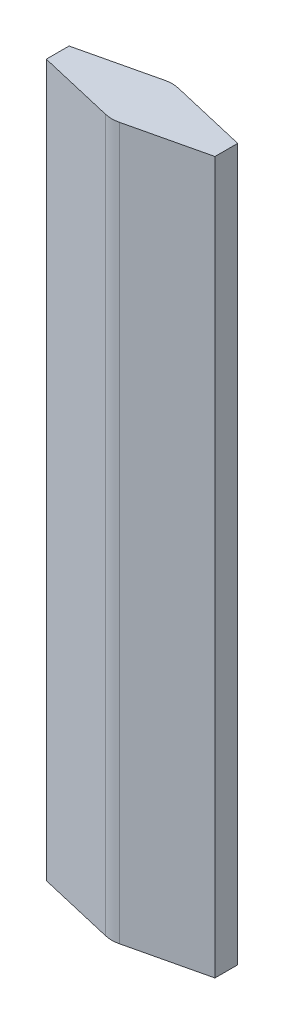
ISO-10303-21;
HEADER;
FILE_DESCRIPTION(('STEP AP214'),'2;1');
FILE_NAME('part.step','',(''),(''),'','','');
FILE_SCHEMA(('AUTOMOTIVE_DESIGN { 1 0 10303 214 1 1 1 1 }'));
ENDSEC;
DATA;
#1=APPLICATION_CONTEXT('core data for automotive mechanical design processes');
#2=APPLICATION_PROTOCOL_DEFINITION('international standard','automotive_design',2000,#1);
#3=PRODUCT_CONTEXT('',#1,'mechanical');
#4=PRODUCT('Part','Part','',(#3));
#5=PRODUCT_RELATED_PRODUCT_CATEGORY('part','',(#4));
#6=PRODUCT_DEFINITION_FORMATION('','',#4);
#7=PRODUCT_DEFINITION_CONTEXT('part definition',#1,'design');
#8=PRODUCT_DEFINITION('design','',#6,#7);
#9=PRODUCT_DEFINITION_SHAPE('','',#8);
#10=(LENGTH_UNIT() NAMED_UNIT(*) SI_UNIT(.MILLI.,.METRE.));
#11=(NAMED_UNIT(*) PLANE_ANGLE_UNIT() SI_UNIT($,.RADIAN.));
#12=(NAMED_UNIT(*) SI_UNIT($,.STERADIAN.) SOLID_ANGLE_UNIT());
#13=UNCERTAINTY_MEASURE_WITH_UNIT(LENGTH_MEASURE(1.E-05),#10,'distance_accuracy_value','');
#14=(GEOMETRIC_REPRESENTATION_CONTEXT(3) GLOBAL_UNCERTAINTY_ASSIGNED_CONTEXT((#13)) GLOBAL_UNIT_ASSIGNED_CONTEXT((#10,
#11,#12)) REPRESENTATION_CONTEXT('',''));
#15=CARTESIAN_POINT('',(0.,0.,0.));
#16=DIRECTION('',(0.,0.,1.));
#17=DIRECTION('',(1.,0.,0.));
#18=AXIS2_PLACEMENT_3D('',#15,#16,#17);
#19=CARTESIAN_POINT('',(-169.28,1600.,31.2266341956425));
#20=DIRECTION('',(0.228,0.,-0.973661132016679));
#21=DIRECTION('',(-0.973661132016679,0.,-0.228));
#22=AXIS2_PLACEMENT_3D('',#19,#20,#21);
#23=PLANE('',#22);
#24=DIRECTION('',(0.973661132016679,0.,0.228));
#25=VECTOR('',#24,1.);
#26=CARTESIAN_POINT('',(-169.28,-10.,31.2266341956425));
#27=LINE('',#26,#25);
#28=CARTESIAN_POINT('',(-191.999999986789,-10.,25.9063437715413));
#29=VERTEX_POINT('',#28);
#30=CARTESIAN_POINT('',(-15.7319998104866,-10.,67.1826181535287));
#31=VERTEX_POINT('',#30);
#32=EDGE_CURVE('E180',#29,#31,#27,.T.);
#33=ORIENTED_EDGE('',*,*,#32,.T.);
#34=DIRECTION('',(0.,-1.,0.));
#35=VECTOR('',#34,1.);
#36=CARTESIAN_POINT('',(-15.7319998104866,1600.,67.1826181535287));
#37=LINE('',#36,#35);
#38=CARTESIAN_POINT('',(-15.7319998104866,1610.,67.1826181535287));
#39=VERTEX_POINT('',#38);
#40=EDGE_CURVE('E182',#39,#31,#37,.T.);
#41=ORIENTED_EDGE('',*,*,#40,.F.);
#42=DIRECTION('',(0.973661132016679,0.,0.228));
#43=VECTOR('',#42,1.);
#44=CARTESIAN_POINT('',(-169.28,1610.,31.2266341956425));
#45=LINE('',#44,#43);
#46=CARTESIAN_POINT('',(-191.999999986789,1610.,25.9063437715413));
#47=VERTEX_POINT('',#46);
#48=EDGE_CURVE('E216',#47,#39,#45,.T.);
#49=ORIENTED_EDGE('',*,*,#48,.F.);
#50=DIRECTION('',(0.,-1.,0.));
#51=VECTOR('',#50,1.);
#52=CARTESIAN_POINT('',(-191.999999986789,1600.,25.9063437715413));
#53=LINE('',#52,#51);
#54=EDGE_CURVE('E185',#47,#29,#53,.T.);
#55=ORIENTED_EDGE('',*,*,#54,.T.);
#56=EDGE_LOOP('',(#33,#41,#49,#55));
#57=FACE_BOUND('',#56,.T.);
#58=ADVANCED_FACE('F40',(#57),#23,.F.);
#59=CARTESIAN_POINT('',(0.,1600.,0.));
#60=DIRECTION('',(0.,-1.,0.));
#61=DIRECTION('',(0.,0.,-1.));
#62=AXIS2_PLACEMENT_3D('',#59,#60,#61);
#63=CYLINDRICAL_SURFACE('',#62,69.);
#64=CARTESIAN_POINT('',(0.,-10.,0.));
#65=DIRECTION('',(0.,1.,0.));
#66=DIRECTION('',(0.,0.,1.));
#67=AXIS2_PLACEMENT_3D('',#64,#65,#66);
#68=CIRCLE('',#67,69.);
#69=CARTESIAN_POINT('',(15.7319999932996,-10.,67.1826180869688));
#70=VERTEX_POINT('',#69);
#71=EDGE_CURVE('E189',#31,#70,#68,.T.);
#72=ORIENTED_EDGE('',*,*,#71,.T.);
#73=DIRECTION('',(0.,1.,0.));
#74=VECTOR('',#73,1.);
#75=CARTESIAN_POINT('',(15.7319999932996,1600.,67.1826180869688));
#76=LINE('',#75,#74);
#77=CARTESIAN_POINT('',(15.7319999932996,1610.,67.1826180869688));
#78=VERTEX_POINT('',#77);
#79=EDGE_CURVE('E198',#78,#70,#76,.F.);
#80=ORIENTED_EDGE('',*,*,#79,.F.);
#81=CARTESIAN_POINT('',(0.,1610.,0.));
#82=DIRECTION('',(0.,1.,0.));
#83=DIRECTION('',(0.,0.,1.));
#84=AXIS2_PLACEMENT_3D('',#81,#82,#83);
#85=CIRCLE('',#84,69.);
#86=EDGE_CURVE('E196',#39,#78,#85,.T.);
#87=ORIENTED_EDGE('',*,*,#86,.F.);
#88=ORIENTED_EDGE('',*,*,#40,.T.);
#89=EDGE_LOOP('',(#72,#80,#87,#88));
#90=FACE_BOUND('',#89,.T.);
#91=ADVANCED_FACE('F193',(#90),#63,.T.);
#92=CARTESIAN_POINT('',(169.279999998572,1600.,31.2266341959768));
#93=DIRECTION('',(-0.227999999857222,0.,-0.973661132050113));
#94=DIRECTION('',(-0.973661132050113,0.,0.227999999857222));
#95=AXIS2_PLACEMENT_3D('',#92,#93,#94);
#96=PLANE('',#95);
#97=DIRECTION('',(0.973661132050113,0.,-0.227999999857222));
#98=VECTOR('',#97,1.);
#99=CARTESIAN_POINT('',(169.279999998572,-10.,31.2266341959768));
#100=LINE('',#99,#98);
#101=CARTESIAN_POINT('',(192.,-10.,25.9063437719621));
#102=VERTEX_POINT('',#101);
#103=EDGE_CURVE('E202',#70,#102,#100,.T.);
#104=ORIENTED_EDGE('',*,*,#103,.T.);
#105=DIRECTION('',(0.,-1.,0.));
#106=VECTOR('',#105,1.);
#107=CARTESIAN_POINT('',(192.,1600.,25.9063437719621));
#108=LINE('',#107,#106);
#109=CARTESIAN_POINT('',(192.,1610.,25.9063437719621));
#110=VERTEX_POINT('',#109);
#111=EDGE_CURVE('E213',#110,#102,#108,.T.);
#112=ORIENTED_EDGE('',*,*,#111,.F.);
#113=DIRECTION('',(0.973661132050113,0.,-0.227999999857222));
#114=VECTOR('',#113,1.);
#115=CARTESIAN_POINT('',(169.279999998572,1610.,31.2266341959768));
#116=LINE('',#115,#114);
#117=EDGE_CURVE('E215',#78,#110,#116,.T.);
#118=ORIENTED_EDGE('',*,*,#117,.F.);
#119=ORIENTED_EDGE('',*,*,#79,.T.);
#120=EDGE_LOOP('',(#104,#112,#118,#119));
#121=FACE_BOUND('',#120,.T.);
#122=ADVANCED_FACE('F355',(#121),#96,.F.);
#123=CARTESIAN_POINT('',(192.,1600.,0.));
#124=DIRECTION('',(-1.,0.,0.));
#125=DIRECTION('',(0.,0.,1.));
#126=AXIS2_PLACEMENT_3D('',#123,#124,#125);
#127=PLANE('',#126);
#128=DIRECTION('',(0.,0.,-1.));
#129=VECTOR('',#128,1.);
#130=CARTESIAN_POINT('',(192.,-10.,0.));
#131=LINE('',#130,#129);
#132=CARTESIAN_POINT('',(192.,-10.,-25.9063437684477));
#133=VERTEX_POINT('',#132);
#134=EDGE_CURVE('E206',#102,#133,#131,.T.);
#135=ORIENTED_EDGE('',*,*,#134,.T.);
#136=DIRECTION('',(0.,-1.,0.));
#137=VECTOR('',#136,1.);
#138=CARTESIAN_POINT('',(192.,1600.,-25.9063437684477));
#139=LINE('',#138,#137);
#140=CARTESIAN_POINT('',(192.,1610.,-25.9063437684477));
#141=VERTEX_POINT('',#140);
#142=EDGE_CURVE('E221',#141,#133,#139,.T.);
#143=ORIENTED_EDGE('',*,*,#142,.F.);
#144=DIRECTION('',(0.,0.,-1.));
#145=VECTOR('',#144,1.);
#146=CARTESIAN_POINT('',(192.,1610.,0.));
#147=LINE('',#146,#145);
#148=EDGE_CURVE('E224',#110,#141,#147,.T.);
#149=ORIENTED_EDGE('',*,*,#148,.F.);
#150=ORIENTED_EDGE('',*,*,#111,.T.);
#151=EDGE_LOOP('',(#135,#143,#149,#150));
#152=FACE_BOUND('',#151,.T.);
#153=ADVANCED_FACE('F348',(#152),#127,.F.);
#154=CARTESIAN_POINT('',(169.28,1600.,-31.2266341956425));
#155=DIRECTION('',(-0.228,0.,0.973661132016679));
#156=DIRECTION('',(0.973661132016679,0.,0.228));
#157=AXIS2_PLACEMENT_3D('',#154,#155,#156);
#158=PLANE('',#157);
#159=DIRECTION('',(-0.973661132016679,0.,-0.228));
#160=VECTOR('',#159,1.);
#161=CARTESIAN_POINT('',(169.28,-10.,-31.2266341956425));
#162=LINE('',#161,#160);
#163=CARTESIAN_POINT('',(15.732,-10.,-67.1826181091508));
#164=VERTEX_POINT('',#163);
#165=EDGE_CURVE('E150',#133,#164,#162,.T.);
#166=ORIENTED_EDGE('',*,*,#165,.T.);
#167=DIRECTION('',(0.,-1.,0.));
#168=VECTOR('',#167,1.);
#169=CARTESIAN_POINT('',(15.732,1600.,-67.1826181091508));
#170=LINE('',#169,#168);
#171=CARTESIAN_POINT('',(15.732,1610.,-67.1826181091508));
#172=VERTEX_POINT('',#171);
#173=EDGE_CURVE('E230',#172,#164,#170,.T.);
#174=ORIENTED_EDGE('',*,*,#173,.F.);
#175=DIRECTION('',(-0.973661132016679,0.,-0.228));
#176=VECTOR('',#175,1.);
#177=CARTESIAN_POINT('',(169.28,1610.,-31.2266341956425));
#178=LINE('',#177,#176);
#179=EDGE_CURVE('E233',#141,#172,#178,.T.);
#180=ORIENTED_EDGE('',*,*,#179,.F.);
#181=ORIENTED_EDGE('',*,*,#142,.T.);
#182=EDGE_LOOP('',(#166,#174,#180,#181));
#183=FACE_BOUND('',#182,.T.);
#184=ADVANCED_FACE('F352',(#183),#158,.F.);
#185=CARTESIAN_POINT('',(0.,1600.,0.));
#186=DIRECTION('',(0.,-1.,0.));
#187=DIRECTION('',(0.,0.,-1.));
#188=AXIS2_PLACEMENT_3D('',#185,#186,#187);
#189=CYLINDRICAL_SURFACE('',#188,69.);
#190=CARTESIAN_POINT('',(0.,-10.,0.));
#191=DIRECTION('',(0.,1.,0.));
#192=DIRECTION('',(0.,0.,1.));
#193=AXIS2_PLACEMENT_3D('',#190,#191,#192);
#194=CIRCLE('',#193,69.);
#195=CARTESIAN_POINT('',(-15.7320000067004,-10.,-67.1826181313328));
#196=VERTEX_POINT('',#195);
#197=EDGE_CURVE('E236',#164,#196,#194,.T.);
#198=ORIENTED_EDGE('',*,*,#197,.T.);
#199=DIRECTION('',(0.,1.,0.));
#200=VECTOR('',#199,1.);
#201=CARTESIAN_POINT('',(-15.7320000067004,1600.,-67.1826181313328));
#202=LINE('',#201,#200);
#203=CARTESIAN_POINT('',(-15.7320000067004,1610.,-67.1826181313328));
#204=VERTEX_POINT('',#203);
#205=EDGE_CURVE('E239',#204,#196,#202,.F.);
#206=ORIENTED_EDGE('',*,*,#205,.F.);
#207=CARTESIAN_POINT('',(0.,1610.,0.));
#208=DIRECTION('',(0.,1.,0.));
#209=DIRECTION('',(0.,0.,1.));
#210=AXIS2_PLACEMENT_3D('',#207,#208,#209);
#211=CIRCLE('',#210,69.);
#212=EDGE_CURVE('E126',#172,#204,#211,.T.);
#213=ORIENTED_EDGE('',*,*,#212,.F.);
#214=ORIENTED_EDGE('',*,*,#173,.T.);
#215=EDGE_LOOP('',(#198,#206,#213,#214));
#216=FACE_BOUND('',#215,.T.);
#217=ADVANCED_FACE('F345',(#216),#189,.T.);
#218=CARTESIAN_POINT('',(-169.280000001428,1600.,-31.2266341953081));
#219=DIRECTION('',(0.228000000142778,0.,0.973661131983245));
#220=DIRECTION('',(0.973661131983245,0.,-0.228000000142778));
#221=AXIS2_PLACEMENT_3D('',#218,#219,#220);
#222=PLANE('',#221);
#223=DIRECTION('',(-0.973661131983245,0.,0.228000000142778));
#224=VECTOR('',#223,1.);
#225=CARTESIAN_POINT('',(-169.280000001428,-10.,-31.2266341953081));
#226=LINE('',#225,#224);
#227=CARTESIAN_POINT('',(-191.999999986789,-10.,-25.9063437680269));
#228=VERTEX_POINT('',#227);
#229=EDGE_CURVE('E141',#196,#228,#226,.T.);
#230=ORIENTED_EDGE('',*,*,#229,.T.);
#231=DIRECTION('',(0.,-1.,0.));
#232=VECTOR('',#231,1.);
#233=CARTESIAN_POINT('',(-191.999999986789,1600.,-25.9063437680269));
#234=LINE('',#233,#232);
#235=CARTESIAN_POINT('',(-191.999999986789,1610.,-25.9063437680269));
#236=VERTEX_POINT('',#235);
#237=EDGE_CURVE('E247',#236,#228,#234,.T.);
#238=ORIENTED_EDGE('',*,*,#237,.F.);
#239=DIRECTION('',(-0.973661131983245,0.,0.228000000142778));
#240=VECTOR('',#239,1.);
#241=CARTESIAN_POINT('',(-169.280000001428,1610.,-31.2266341953081));
#242=LINE('',#241,#240);
#243=EDGE_CURVE('E120',#204,#236,#242,.T.);
#244=ORIENTED_EDGE('',*,*,#243,.F.);
#245=ORIENTED_EDGE('',*,*,#205,.T.);
#246=EDGE_LOOP('',(#230,#238,#244,#245));
#247=FACE_BOUND('',#246,.T.);
#248=ADVANCED_FACE('F343',(#247),#222,.F.);
#249=CARTESIAN_POINT('',(-191.999999986789,1600.,0.));
#250=DIRECTION('',(1.,0.,0.));
#251=DIRECTION('',(0.,0.,-1.));
#252=AXIS2_PLACEMENT_3D('',#249,#250,#251);
#253=PLANE('',#252);
#254=DIRECTION('',(0.,0.,1.));
#255=VECTOR('',#254,1.);
#256=CARTESIAN_POINT('',(-191.999999986789,-10.,0.));
#257=LINE('',#256,#255);
#258=EDGE_CURVE('E252',#228,#29,#257,.T.);
#259=ORIENTED_EDGE('',*,*,#258,.T.);
#260=ORIENTED_EDGE('',*,*,#54,.F.);
#261=DIRECTION('',(0.,0.,1.));
#262=VECTOR('',#261,1.);
#263=CARTESIAN_POINT('',(-191.999999986789,1610.,0.));
#264=LINE('',#263,#262);
#265=EDGE_CURVE('E260',#236,#47,#264,.T.);
#266=ORIENTED_EDGE('',*,*,#265,.F.);
#267=ORIENTED_EDGE('',*,*,#237,.T.);
#268=EDGE_LOOP('',(#259,#260,#266,#267));
#269=FACE_BOUND('',#268,.T.);
#270=ADVANCED_FACE('F341',(#269),#253,.F.);
#271=CARTESIAN_POINT('',(0.,1610.,0.));
#272=DIRECTION('',(0.,1.,0.));
#273=DIRECTION('',(0.,0.,1.));
#274=AXIS2_PLACEMENT_3D('',#271,#272,#273);
#275=PLANE('',#274);
#276=ORIENTED_EDGE('',*,*,#265,.T.);
#277=ORIENTED_EDGE('',*,*,#48,.T.);
#278=ORIENTED_EDGE('',*,*,#86,.T.);
#279=ORIENTED_EDGE('',*,*,#117,.T.);
#280=ORIENTED_EDGE('',*,*,#148,.T.);
#281=ORIENTED_EDGE('',*,*,#179,.T.);
#282=ORIENTED_EDGE('',*,*,#212,.T.);
#283=ORIENTED_EDGE('',*,*,#243,.T.);
#284=EDGE_LOOP('',(#276,#277,#278,#279,#280,#281,#282,#283));
#285=FACE_BOUND('',#284,.T.);
#286=ADVANCED_FACE('F338',(#285),#275,.T.);
#287=CARTESIAN_POINT('',(0.,-10.,0.));
#288=DIRECTION('',(0.,1.,0.));
#289=DIRECTION('',(0.,0.,1.));
#290=AXIS2_PLACEMENT_3D('',#287,#288,#289);
#291=PLANE('',#290);
#292=ORIENTED_EDGE('',*,*,#32,.F.);
#293=ORIENTED_EDGE('',*,*,#258,.F.);
#294=ORIENTED_EDGE('',*,*,#229,.F.);
#295=ORIENTED_EDGE('',*,*,#197,.F.);
#296=ORIENTED_EDGE('',*,*,#165,.F.);
#297=ORIENTED_EDGE('',*,*,#134,.F.);
#298=ORIENTED_EDGE('',*,*,#103,.F.);
#299=ORIENTED_EDGE('',*,*,#71,.F.);
#300=EDGE_LOOP('',(#292,#293,#294,#295,#296,#297,#298,#299));
#301=FACE_BOUND('',#300,.T.);
#302=ADVANCED_FACE('F200',(#301),#291,.F.);
#303=CLOSED_SHELL('',(#58,#91,#122,#153,#184,#217,#248,#270,#286,#302));
#304=CARTESIAN_POINT('',(-167.,1600.,21.4900228754757));
#305=DIRECTION('',(0.228,0.,-0.973661132016679));
#306=DIRECTION('',(-0.973661132016679,0.,-0.228));
#307=AXIS2_PLACEMENT_3D('',#304,#305,#306);
#308=PLANE('',#307);
#309=DIRECTION('',(0.973661132016679,0.,0.228));
#310=VECTOR('',#309,1.);
#311=CARTESIAN_POINT('',(-167.,0.,21.4900228754757));
#312=LINE('',#311,#310);
#313=CARTESIAN_POINT('',(-181.999999986789,0.,17.9775071916009));
#314=VERTEX_POINT('',#313);
#315=CARTESIAN_POINT('',(-13.4519998379523,0.,57.4460068269304));
#316=VERTEX_POINT('',#315);
#317=EDGE_CURVE('E44',#314,#316,#312,.T.);
#318=ORIENTED_EDGE('',*,*,#317,.F.);
#319=DIRECTION('',(0.,-1.,0.));
#320=VECTOR('',#319,1.);
#321=CARTESIAN_POINT('',(-181.999999986789,1600.,17.9775071916009));
#322=LINE('',#321,#320);
#323=CARTESIAN_POINT('',(-181.999999986789,1600.,17.9775071916009));
#324=VERTEX_POINT('',#323);
#325=EDGE_CURVE('E329',#324,#314,#322,.T.);
#326=ORIENTED_EDGE('',*,*,#325,.F.);
#327=DIRECTION('',(0.973661132016679,0.,0.227999999999999));
#328=VECTOR('',#327,1.);
#329=CARTESIAN_POINT('',(-167.,1600.,21.4900228754757));
#330=LINE('',#329,#328);
#331=CARTESIAN_POINT('',(-13.4519998379523,1600.,57.4460068269304));
#332=VERTEX_POINT('',#331);
#333=EDGE_CURVE('E108',#324,#332,#330,.T.);
#334=ORIENTED_EDGE('',*,*,#333,.T.);
#335=DIRECTION('',(0.,-1.,0.));
#336=VECTOR('',#335,1.);
#337=CARTESIAN_POINT('',(-13.4519998379523,1600.,57.4460068269304));
#338=LINE('',#337,#336);
#339=EDGE_CURVE('E324',#332,#316,#338,.T.);
#340=ORIENTED_EDGE('',*,*,#339,.T.);
#341=EDGE_LOOP('',(#318,#326,#334,#340));
#342=FACE_BOUND('',#341,.T.);
#343=ADVANCED_FACE('F441',(#342),#308,.T.);
#344=CARTESIAN_POINT('',(0.,1600.,0.));
#345=DIRECTION('',(0.,-1.,0.));
#346=DIRECTION('',(0.,0.,-1.));
#347=AXIS2_PLACEMENT_3D('',#344,#345,#346);
#348=CYLINDRICAL_SURFACE('',#347,59.);
#349=CARTESIAN_POINT('',(0.,0.,0.));
#350=DIRECTION('',(0.,1.,0.));
#351=DIRECTION('',(0.,0.,1.));
#352=AXIS2_PLACEMENT_3D('',#349,#350,#351);
#353=CIRCLE('',#352,59.);
#354=CARTESIAN_POINT('',(13.452,0.,57.446006788984));
#355=VERTEX_POINT('',#354);
#356=EDGE_CURVE('E327',#316,#355,#353,.T.);
#357=ORIENTED_EDGE('',*,*,#356,.F.);
#358=ORIENTED_EDGE('',*,*,#339,.F.);
#359=CARTESIAN_POINT('',(0.,1600.,0.));
#360=DIRECTION('',(0.,1.,0.));
#361=DIRECTION('',(0.,0.,1.));
#362=AXIS2_PLACEMENT_3D('',#359,#360,#361);
#363=CIRCLE('',#362,59.);
#364=CARTESIAN_POINT('',(13.452,1600.,57.446006788984));
#365=VERTEX_POINT('',#364);
#366=EDGE_CURVE('E274',#332,#365,#363,.T.);
#367=ORIENTED_EDGE('',*,*,#366,.T.);
#368=DIRECTION('',(0.,-1.,0.));
#369=VECTOR('',#368,1.);
#370=CARTESIAN_POINT('',(13.452,1600.,57.446006788984));
#371=LINE('',#370,#369);
#372=EDGE_CURVE('E318',#365,#355,#371,.T.);
#373=ORIENTED_EDGE('',*,*,#372,.T.);
#374=EDGE_LOOP('',(#357,#358,#367,#373));
#375=FACE_BOUND('',#374,.T.);
#376=ADVANCED_FACE('F445',(#375),#348,.F.);
#377=CARTESIAN_POINT('',(167.,1600.,21.4900228754757));
#378=DIRECTION('',(-0.227999999857222,0.,-0.973661132050113));
#379=DIRECTION('',(-0.973661132050113,0.,0.227999999857222));
#380=AXIS2_PLACEMENT_3D('',#377,#378,#379);
#381=PLANE('',#380);
#382=DIRECTION('',(0.973661132050113,0.,-0.227999999857222));
#383=VECTOR('',#382,1.);
#384=CARTESIAN_POINT('',(167.,0.,21.4900228754757));
#385=LINE('',#384,#383);
#386=CARTESIAN_POINT('',(182.,0.,17.9775071908275));
#387=VERTEX_POINT('',#386);
#388=EDGE_CURVE('E61',#355,#387,#385,.T.);
#389=ORIENTED_EDGE('',*,*,#388,.F.);
#390=ORIENTED_EDGE('',*,*,#372,.F.);
#391=DIRECTION('',(0.973661132016679,0.,-0.228));
#392=VECTOR('',#391,1.);
#393=CARTESIAN_POINT('',(13.452,1600.,57.446006788984));
#394=LINE('',#393,#392);
#395=CARTESIAN_POINT('',(182.,1600.,17.9775071908275));
#396=VERTEX_POINT('',#395);
#397=EDGE_CURVE('E271',#365,#396,#394,.T.);
#398=ORIENTED_EDGE('',*,*,#397,.T.);
#399=DIRECTION('',(0.,-1.,0.));
#400=VECTOR('',#399,1.);
#401=CARTESIAN_POINT('',(182.,1600.,17.9775071908275));
#402=LINE('',#401,#400);
#403=EDGE_CURVE('E311',#396,#387,#402,.T.);
#404=ORIENTED_EDGE('',*,*,#403,.T.);
#405=EDGE_LOOP('',(#389,#390,#398,#404));
#406=FACE_BOUND('',#405,.T.);
#407=ADVANCED_FACE('F457',(#406),#381,.T.);
#408=CARTESIAN_POINT('',(182.,1600.,0.));
#409=DIRECTION('',(-1.,0.,0.));
#410=DIRECTION('',(0.,0.,1.));
#411=AXIS2_PLACEMENT_3D('',#408,#409,#410);
#412=PLANE('',#411);
#413=DIRECTION('',(0.,0.,-1.));
#414=VECTOR('',#413,1.);
#415=CARTESIAN_POINT('',(182.,0.,0.));
#416=LINE('',#415,#414);
#417=CARTESIAN_POINT('',(182.,0.,-17.9775071885073));
#418=VERTEX_POINT('',#417);
#419=EDGE_CURVE('E314',#387,#418,#416,.T.);
#420=ORIENTED_EDGE('',*,*,#419,.F.);
#421=ORIENTED_EDGE('',*,*,#403,.F.);
#422=DIRECTION('',(0.,0.,-1.));
#423=VECTOR('',#422,1.);
#424=CARTESIAN_POINT('',(182.,1600.,0.));
#425=LINE('',#424,#423);
#426=CARTESIAN_POINT('',(182.,1600.,-17.9775071885073));
#427=VERTEX_POINT('',#426);
#428=EDGE_CURVE('E268',#396,#427,#425,.T.);
#429=ORIENTED_EDGE('',*,*,#428,.T.);
#430=DIRECTION('',(0.,-1.,0.));
#431=VECTOR('',#430,1.);
#432=CARTESIAN_POINT('',(182.,1600.,-17.9775071885073));
#433=LINE('',#432,#431);
#434=EDGE_CURVE('E304',#427,#418,#433,.T.);
#435=ORIENTED_EDGE('',*,*,#434,.T.);
#436=EDGE_LOOP('',(#420,#421,#429,#435));
#437=FACE_BOUND('',#436,.T.);
#438=ADVANCED_FACE('F467',(#437),#412,.T.);
#439=CARTESIAN_POINT('',(167.,1600.,-21.4900228754757));
#440=DIRECTION('',(-0.228,0.,0.973661132016679));
#441=DIRECTION('',(0.973661132016679,0.,0.228));
#442=AXIS2_PLACEMENT_3D('',#439,#440,#441);
#443=PLANE('',#442);
#444=DIRECTION('',(-0.973661132016679,0.,-0.228));
#445=VECTOR('',#444,1.);
#446=CARTESIAN_POINT('',(167.,0.,-21.4900228754757));
#447=LINE('',#446,#445);
#448=CARTESIAN_POINT('',(13.452,0.,-57.446006788984));
#449=VERTEX_POINT('',#448);
#450=EDGE_CURVE('E308',#418,#449,#447,.T.);
#451=ORIENTED_EDGE('',*,*,#450,.F.);
#452=ORIENTED_EDGE('',*,*,#434,.F.);
#453=DIRECTION('',(-0.973661132016678,0.,-0.228000000000001));
#454=VECTOR('',#453,1.);
#455=CARTESIAN_POINT('',(167.,1600.,-21.4900228754757));
#456=LINE('',#455,#454);
#457=CARTESIAN_POINT('',(13.452,1600.,-57.446006788984));
#458=VERTEX_POINT('',#457);
#459=EDGE_CURVE('E265',#427,#458,#456,.T.);
#460=ORIENTED_EDGE('',*,*,#459,.T.);
#461=DIRECTION('',(0.,-1.,0.));
#462=VECTOR('',#461,1.);
#463=CARTESIAN_POINT('',(13.452,1600.,-57.446006788984));
#464=LINE('',#463,#462);
#465=EDGE_CURVE('E296',#458,#449,#464,.T.);
#466=ORIENTED_EDGE('',*,*,#465,.T.);
#467=EDGE_LOOP('',(#451,#452,#460,#466));
#468=FACE_BOUND('',#467,.T.);
#469=ADVANCED_FACE('F477',(#468),#443,.T.);
#470=CARTESIAN_POINT('',(0.,1600.,0.));
#471=DIRECTION('',(0.,-1.,0.));
#472=DIRECTION('',(0.,0.,-1.));
#473=AXIS2_PLACEMENT_3D('',#470,#471,#472);
#474=CYLINDRICAL_SURFACE('',#473,59.);
#475=CARTESIAN_POINT('',(0.,0.,0.));
#476=DIRECTION('',(0.,1.,0.));
#477=DIRECTION('',(0.,0.,1.));
#478=AXIS2_PLACEMENT_3D('',#475,#476,#477);
#479=CIRCLE('',#478,59.);
#480=CARTESIAN_POINT('',(-13.452,0.,-57.446006788984));
#481=VERTEX_POINT('',#480);
#482=EDGE_CURVE('E300',#449,#481,#479,.T.);
#483=ORIENTED_EDGE('',*,*,#482,.F.);
#484=ORIENTED_EDGE('',*,*,#465,.F.);
#485=CARTESIAN_POINT('',(0.,1600.,0.));
#486=DIRECTION('',(0.,1.,0.));
#487=DIRECTION('',(0.,0.,1.));
#488=AXIS2_PLACEMENT_3D('',#485,#486,#487);
#489=CIRCLE('',#488,59.);
#490=CARTESIAN_POINT('',(-13.452,1600.,-57.446006788984));
#491=VERTEX_POINT('',#490);
#492=EDGE_CURVE('E52',#458,#491,#489,.T.);
#493=ORIENTED_EDGE('',*,*,#492,.T.);
#494=DIRECTION('',(0.,-1.,0.));
#495=VECTOR('',#494,1.);
#496=CARTESIAN_POINT('',(-13.452,1600.,-57.446006788984));
#497=LINE('',#496,#495);
#498=EDGE_CURVE('E289',#491,#481,#497,.T.);
#499=ORIENTED_EDGE('',*,*,#498,.T.);
#500=EDGE_LOOP('',(#483,#484,#493,#499));
#501=FACE_BOUND('',#500,.T.);
#502=ADVANCED_FACE('F488',(#501),#474,.F.);
#503=CARTESIAN_POINT('',(-167.,1600.,-21.4900228754757));
#504=DIRECTION('',(0.228000000142778,0.,0.973661131983245));
#505=DIRECTION('',(0.973661131983245,0.,-0.228000000142778));
#506=AXIS2_PLACEMENT_3D('',#503,#504,#505);
#507=PLANE('',#506);
#508=DIRECTION('',(-0.973661131983245,0.,0.228000000142778));
#509=VECTOR('',#508,1.);
#510=CARTESIAN_POINT('',(-167.,0.,-21.4900228754757));
#511=LINE('',#510,#509);
#512=CARTESIAN_POINT('',(-181.999999986789,0.,-17.9775071892807));
#513=VERTEX_POINT('',#512);
#514=EDGE_CURVE('E293',#481,#513,#511,.T.);
#515=ORIENTED_EDGE('',*,*,#514,.F.);
#516=ORIENTED_EDGE('',*,*,#498,.F.);
#517=DIRECTION('',(-0.973661132016679,0.,0.228));
#518=VECTOR('',#517,1.);
#519=CARTESIAN_POINT('',(-13.452,1600.,-57.446006788984));
#520=LINE('',#519,#518);
#521=CARTESIAN_POINT('',(-181.999999986789,1600.,-17.9775071892807));
#522=VERTEX_POINT('',#521);
#523=EDGE_CURVE('E11',#491,#522,#520,.T.);
#524=ORIENTED_EDGE('',*,*,#523,.T.);
#525=DIRECTION('',(0.,-1.,0.));
#526=VECTOR('',#525,1.);
#527=CARTESIAN_POINT('',(-181.999999986789,1600.,-17.9775071892807));
#528=LINE('',#527,#526);
#529=EDGE_CURVE('E282',#522,#513,#528,.T.);
#530=ORIENTED_EDGE('',*,*,#529,.T.);
#531=EDGE_LOOP('',(#515,#516,#524,#530));
#532=FACE_BOUND('',#531,.T.);
#533=ADVANCED_FACE('F499',(#532),#507,.T.);
#534=CARTESIAN_POINT('',(-181.999999986789,1600.,0.));
#535=DIRECTION('',(1.,0.,0.));
#536=DIRECTION('',(0.,0.,-1.));
#537=AXIS2_PLACEMENT_3D('',#534,#535,#536);
#538=PLANE('',#537);
#539=DIRECTION('',(0.,0.,1.));
#540=VECTOR('',#539,1.);
#541=CARTESIAN_POINT('',(-181.999999986789,0.,0.));
#542=LINE('',#541,#540);
#543=EDGE_CURVE('E286',#513,#314,#542,.T.);
#544=ORIENTED_EDGE('',*,*,#543,.F.);
#545=ORIENTED_EDGE('',*,*,#529,.F.);
#546=DIRECTION('',(0.,0.,1.));
#547=VECTOR('',#546,1.);
#548=CARTESIAN_POINT('',(-181.999999986789,1600.,0.));
#549=LINE('',#548,#547);
#550=EDGE_CURVE('E279',#522,#324,#549,.T.);
#551=ORIENTED_EDGE('',*,*,#550,.T.);
#552=ORIENTED_EDGE('',*,*,#325,.T.);
#553=EDGE_LOOP('',(#544,#545,#551,#552));
#554=FACE_BOUND('',#553,.T.);
#555=ADVANCED_FACE('F509',(#554),#538,.T.);
#556=CARTESIAN_POINT('',(0.,1600.,0.));
#557=DIRECTION('',(0.,1.,0.));
#558=DIRECTION('',(0.,0.,1.));
#559=AXIS2_PLACEMENT_3D('',#556,#557,#558);
#560=PLANE('',#559);
#561=ORIENTED_EDGE('',*,*,#550,.F.);
#562=ORIENTED_EDGE('',*,*,#523,.F.);
#563=ORIENTED_EDGE('',*,*,#492,.F.);
#564=ORIENTED_EDGE('',*,*,#459,.F.);
#565=ORIENTED_EDGE('',*,*,#428,.F.);
#566=ORIENTED_EDGE('',*,*,#397,.F.);
#567=ORIENTED_EDGE('',*,*,#366,.F.);
#568=ORIENTED_EDGE('',*,*,#333,.F.);
#569=EDGE_LOOP('',(#561,#562,#563,#564,#565,#566,#567,#568));
#570=FACE_BOUND('',#569,.T.);
#571=ADVANCED_FACE('F520',(#570),#560,.F.);
#572=CARTESIAN_POINT('',(0.,0.,0.));
#573=DIRECTION('',(0.,1.,0.));
#574=DIRECTION('',(0.,0.,1.));
#575=AXIS2_PLACEMENT_3D('',#572,#573,#574);
#576=PLANE('',#575);
#577=ORIENTED_EDGE('',*,*,#317,.T.);
#578=ORIENTED_EDGE('',*,*,#356,.T.);
#579=ORIENTED_EDGE('',*,*,#388,.T.);
#580=ORIENTED_EDGE('',*,*,#419,.T.);
#581=ORIENTED_EDGE('',*,*,#450,.T.);
#582=ORIENTED_EDGE('',*,*,#482,.T.);
#583=ORIENTED_EDGE('',*,*,#514,.T.);
#584=ORIENTED_EDGE('',*,*,#543,.T.);
#585=EDGE_LOOP('',(#577,#578,#579,#580,#581,#582,#583,#584));
#586=FACE_BOUND('',#585,.T.);
#587=ADVANCED_FACE('F42',(#586),#576,.T.);
#588=CLOSED_SHELL('',(#343,#376,#407,#438,#469,#502,#533,#555,#571,#587));
#589=ORIENTED_CLOSED_SHELL('',*,#588,.T.);
#590=BREP_WITH_VOIDS('B2',#303,(#589));
#591=ADVANCED_BREP_SHAPE_REPRESENTATION('',(#18,#590),#14);
#592=SHAPE_DEFINITION_REPRESENTATION(#9,#591);
ENDSEC;
END-ISO-10303-21;
